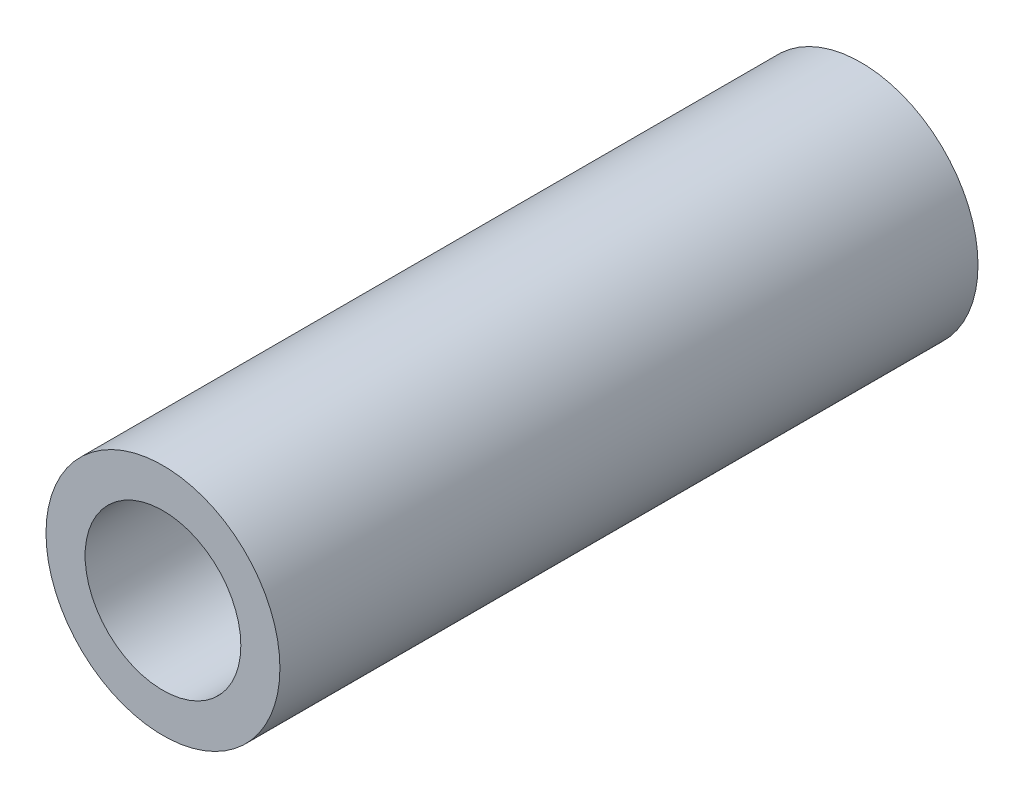
ISO-10303-21;
HEADER;
FILE_DESCRIPTION(('STEP AP214'),'2;1');
FILE_NAME('part.step','',(''),(''),'','','');
FILE_SCHEMA(('AUTOMOTIVE_DESIGN { 1 0 10303 214 1 1 1 1 }'));
ENDSEC;
DATA;
#1=APPLICATION_CONTEXT('core data for automotive mechanical design processes');
#2=APPLICATION_PROTOCOL_DEFINITION('international standard','automotive_design',2000,#1);
#3=PRODUCT_CONTEXT('',#1,'mechanical');
#4=PRODUCT('Part','Part','',(#3));
#5=PRODUCT_RELATED_PRODUCT_CATEGORY('part','',(#4));
#6=PRODUCT_DEFINITION_FORMATION('','',#4);
#7=PRODUCT_DEFINITION_CONTEXT('part definition',#1,'design');
#8=PRODUCT_DEFINITION('design','',#6,#7);
#9=PRODUCT_DEFINITION_SHAPE('','',#8);
#10=(LENGTH_UNIT() NAMED_UNIT(*) SI_UNIT(.MILLI.,.METRE.));
#11=(NAMED_UNIT(*) PLANE_ANGLE_UNIT() SI_UNIT($,.RADIAN.));
#12=(NAMED_UNIT(*) SI_UNIT($,.STERADIAN.) SOLID_ANGLE_UNIT());
#13=UNCERTAINTY_MEASURE_WITH_UNIT(LENGTH_MEASURE(1.E-05),#10,'distance_accuracy_value','');
#14=(GEOMETRIC_REPRESENTATION_CONTEXT(3) GLOBAL_UNCERTAINTY_ASSIGNED_CONTEXT((#13)) GLOBAL_UNIT_ASSIGNED_CONTEXT((#10,
#11,#12)) REPRESENTATION_CONTEXT('',''));
#15=CARTESIAN_POINT('',(0.,0.,0.));
#16=DIRECTION('',(0.,0.,1.));
#17=DIRECTION('',(1.,0.,0.));
#18=AXIS2_PLACEMENT_3D('',#15,#16,#17);
#19=CARTESIAN_POINT('',(0.,0.,14.2875));
#20=DIRECTION('',(0.,0.,1.));
#21=DIRECTION('',(1.,0.,0.));
#22=AXIS2_PLACEMENT_3D('',#19,#20,#21);
#23=PLANE('',#22);
#24=CARTESIAN_POINT('',(0.,0.,14.2875));
#25=DIRECTION('',(0.,0.,1.));
#26=DIRECTION('',(1.,0.,0.));
#27=AXIS2_PLACEMENT_3D('',#24,#25,#26);
#28=CIRCLE('',#27,4.7879);
#29=CARTESIAN_POINT('',(4.7879,0.,14.2875));
#30=VERTEX_POINT('',#29);
#31=EDGE_CURVE('E10',#30,#30,#28,.T.);
#32=ORIENTED_EDGE('',*,*,#31,.T.);
#33=EDGE_LOOP('',(#32));
#34=FACE_BOUND('',#33,.T.);
#35=CARTESIAN_POINT('',(0.,0.,14.2875));
#36=DIRECTION('',(0.,0.,1.));
#37=DIRECTION('',(1.,0.,0.));
#38=AXIS2_PLACEMENT_3D('',#35,#36,#37);
#39=CIRCLE('',#38,3.1877);
#40=CARTESIAN_POINT('',(3.1877,0.,14.2875));
#41=VERTEX_POINT('',#40);
#42=EDGE_CURVE('E46',#41,#41,#39,.T.);
#43=ORIENTED_EDGE('',*,*,#42,.F.);
#44=EDGE_LOOP('',(#43));
#45=FACE_BOUND('',#44,.T.);
#46=ADVANCED_FACE('F35',(#34,#45),#23,.T.);
#47=CARTESIAN_POINT('',(0.,0.,-14.2875));
#48=DIRECTION('',(0.,0.,1.));
#49=DIRECTION('',(1.,0.,0.));
#50=AXIS2_PLACEMENT_3D('',#47,#48,#49);
#51=PLANE('',#50);
#52=CARTESIAN_POINT('',(0.,0.,-14.2875));
#53=DIRECTION('',(0.,0.,1.));
#54=DIRECTION('',(1.,0.,0.));
#55=AXIS2_PLACEMENT_3D('',#52,#53,#54);
#56=CIRCLE('',#55,4.7879);
#57=CARTESIAN_POINT('',(4.7879,0.,-14.2875));
#58=VERTEX_POINT('',#57);
#59=EDGE_CURVE('E39',#58,#58,#56,.T.);
#60=ORIENTED_EDGE('',*,*,#59,.F.);
#61=EDGE_LOOP('',(#60));
#62=FACE_BOUND('',#61,.T.);
#63=CARTESIAN_POINT('',(0.,0.,-14.2875));
#64=DIRECTION('',(0.,0.,1.));
#65=DIRECTION('',(1.,0.,0.));
#66=AXIS2_PLACEMENT_3D('',#63,#64,#65);
#67=CIRCLE('',#66,3.1877);
#68=CARTESIAN_POINT('',(3.1877,0.,-14.2875));
#69=VERTEX_POINT('',#68);
#70=EDGE_CURVE('E48',#69,#69,#67,.T.);
#71=ORIENTED_EDGE('',*,*,#70,.T.);
#72=EDGE_LOOP('',(#71));
#73=FACE_BOUND('',#72,.T.);
#74=ADVANCED_FACE('F58',(#62,#73),#51,.F.);
#75=CARTESIAN_POINT('',(0.,0.,14.2875));
#76=DIRECTION('',(0.,0.,-1.));
#77=DIRECTION('',(-1.,0.,0.));
#78=AXIS2_PLACEMENT_3D('',#75,#76,#77);
#79=CYLINDRICAL_SURFACE('',#78,4.7879);
#80=ORIENTED_EDGE('',*,*,#31,.F.);
#81=EDGE_LOOP('',(#80));
#82=FACE_BOUND('',#81,.T.);
#83=ORIENTED_EDGE('',*,*,#59,.T.);
#84=EDGE_LOOP('',(#83));
#85=FACE_BOUND('',#84,.T.);
#86=ADVANCED_FACE('F37',(#82,#85),#79,.T.);
#87=CARTESIAN_POINT('',(0.,0.,14.2875));
#88=DIRECTION('',(0.,0.,-1.));
#89=DIRECTION('',(-1.,0.,0.));
#90=AXIS2_PLACEMENT_3D('',#87,#88,#89);
#91=CYLINDRICAL_SURFACE('',#90,3.1877);
#92=ORIENTED_EDGE('',*,*,#42,.T.);
#93=EDGE_LOOP('',(#92));
#94=FACE_BOUND('',#93,.T.);
#95=ORIENTED_EDGE('',*,*,#70,.F.);
#96=EDGE_LOOP('',(#95));
#97=FACE_BOUND('',#96,.T.);
#98=ADVANCED_FACE('F54',(#94,#97),#91,.F.);
#99=CLOSED_SHELL('',(#46,#74,#86,#98));
#100=MANIFOLD_SOLID_BREP('B2',#99);
#101=ADVANCED_BREP_SHAPE_REPRESENTATION('',(#18,#100),#14);
#102=SHAPE_DEFINITION_REPRESENTATION(#9,#101);
ENDSEC;
END-ISO-10303-21;
